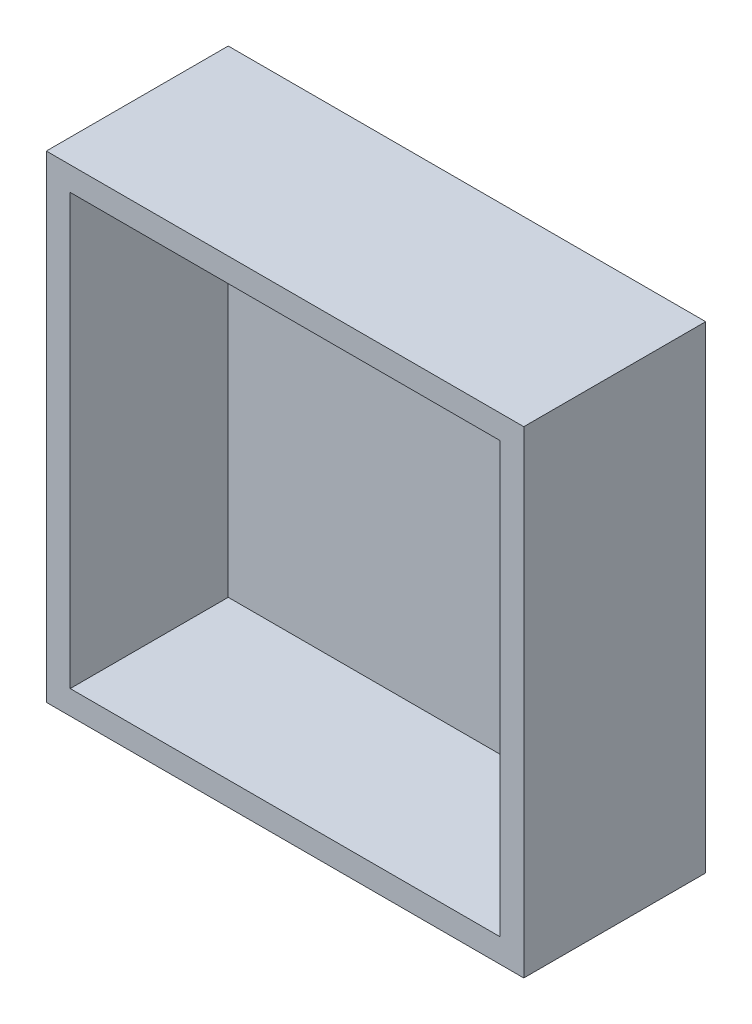
ISO-10303-21;
HEADER;
FILE_DESCRIPTION(('STEP AP214'),'2;1');
FILE_NAME('part.step','',(''),(''),'','','');
FILE_SCHEMA(('AUTOMOTIVE_DESIGN { 1 0 10303 214 1 1 1 1 }'));
ENDSEC;
DATA;
#1=APPLICATION_CONTEXT('core data for automotive mechanical design processes');
#2=APPLICATION_PROTOCOL_DEFINITION('international standard','automotive_design',2000,#1);
#3=PRODUCT_CONTEXT('',#1,'mechanical');
#4=PRODUCT('Part','Part','',(#3));
#5=PRODUCT_RELATED_PRODUCT_CATEGORY('part','',(#4));
#6=PRODUCT_DEFINITION_FORMATION('','',#4);
#7=PRODUCT_DEFINITION_CONTEXT('part definition',#1,'design');
#8=PRODUCT_DEFINITION('design','',#6,#7);
#9=PRODUCT_DEFINITION_SHAPE('','',#8);
#10=(LENGTH_UNIT() NAMED_UNIT(*) SI_UNIT(.MILLI.,.METRE.));
#11=(NAMED_UNIT(*) PLANE_ANGLE_UNIT() SI_UNIT($,.RADIAN.));
#12=(NAMED_UNIT(*) SI_UNIT($,.STERADIAN.) SOLID_ANGLE_UNIT());
#13=UNCERTAINTY_MEASURE_WITH_UNIT(LENGTH_MEASURE(1.E-05),#10,'distance_accuracy_value','');
#14=(GEOMETRIC_REPRESENTATION_CONTEXT(3) GLOBAL_UNCERTAINTY_ASSIGNED_CONTEXT((#13)) GLOBAL_UNIT_ASSIGNED_CONTEXT((#10,
#11,#12)) REPRESENTATION_CONTEXT('',''));
#15=CARTESIAN_POINT('',(0.,0.,0.));
#16=DIRECTION('',(0.,0.,1.));
#17=DIRECTION('',(1.,0.,0.));
#18=AXIS2_PLACEMENT_3D('',#15,#16,#17);
#19=CARTESIAN_POINT('',(-190.,190.,-3.8));
#20=DIRECTION('',(-1.,0.,0.));
#21=DIRECTION('',(0.,-1.,0.));
#22=AXIS2_PLACEMENT_3D('',#19,#20,#21);
#23=PLANE('',#22);
#24=DIRECTION('',(0.,-1.,0.));
#25=VECTOR('',#24,1.);
#26=CARTESIAN_POINT('',(-190.,9.99999999999998,10.));
#27=LINE('',#26,#25);
#28=CARTESIAN_POINT('',(-190.,190.,10.));
#29=VERTEX_POINT('',#28);
#30=CARTESIAN_POINT('',(-190.,9.99999999999998,10.));
#31=VERTEX_POINT('',#30);
#32=EDGE_CURVE('E55',#29,#31,#27,.T.);
#33=ORIENTED_EDGE('',*,*,#32,.F.);
#34=DIRECTION('',(0.,0.,1.));
#35=VECTOR('',#34,1.);
#36=CARTESIAN_POINT('',(-190.,190.,-3.8));
#37=LINE('',#36,#35);
#38=CARTESIAN_POINT('',(-190.,190.,76.2));
#39=VERTEX_POINT('',#38);
#40=EDGE_CURVE('E146',#29,#39,#37,.T.);
#41=ORIENTED_EDGE('',*,*,#40,.T.);
#42=DIRECTION('',(0.,-1.,0.));
#43=VECTOR('',#42,1.);
#44=CARTESIAN_POINT('',(-190.,190.,76.2));
#45=LINE('',#44,#43);
#46=CARTESIAN_POINT('',(-190.,9.99999999999998,76.2));
#47=VERTEX_POINT('',#46);
#48=EDGE_CURVE('E133',#39,#47,#45,.T.);
#49=ORIENTED_EDGE('',*,*,#48,.T.);
#50=DIRECTION('',(0.,0.,1.));
#51=VECTOR('',#50,1.);
#52=CARTESIAN_POINT('',(-190.,9.99999999999998,-3.8));
#53=LINE('',#52,#51);
#54=EDGE_CURVE('E117',#31,#47,#53,.T.);
#55=ORIENTED_EDGE('',*,*,#54,.F.);
#56=EDGE_LOOP('',(#33,#41,#49,#55));
#57=FACE_BOUND('',#56,.T.);
#58=ADVANCED_FACE('F39',(#57),#23,.F.);
#59=CARTESIAN_POINT('',(-190.,190.,-3.8));
#60=DIRECTION('',(0.,1.,0.));
#61=DIRECTION('',(0.,0.,1.));
#62=AXIS2_PLACEMENT_3D('',#59,#60,#61);
#63=PLANE('',#62);
#64=DIRECTION('',(-1.,0.,0.));
#65=VECTOR('',#64,1.);
#66=CARTESIAN_POINT('',(-190.,190.,10.));
#67=LINE('',#66,#65);
#68=CARTESIAN_POINT('',(-10.,190.,10.));
#69=VERTEX_POINT('',#68);
#70=EDGE_CURVE('E62',#69,#29,#67,.T.);
#71=ORIENTED_EDGE('',*,*,#70,.F.);
#72=DIRECTION('',(0.,0.,1.));
#73=VECTOR('',#72,1.);
#74=CARTESIAN_POINT('',(-10.,190.,-3.8));
#75=LINE('',#74,#73);
#76=CARTESIAN_POINT('',(-10.,190.,76.2));
#77=VERTEX_POINT('',#76);
#78=EDGE_CURVE('E116',#69,#77,#75,.T.);
#79=ORIENTED_EDGE('',*,*,#78,.T.);
#80=DIRECTION('',(-1.,0.,0.));
#81=VECTOR('',#80,1.);
#82=CARTESIAN_POINT('',(-190.,190.,76.2));
#83=LINE('',#82,#81);
#84=EDGE_CURVE('E142',#77,#39,#83,.T.);
#85=ORIENTED_EDGE('',*,*,#84,.T.);
#86=ORIENTED_EDGE('',*,*,#40,.F.);
#87=EDGE_LOOP('',(#71,#79,#85,#86));
#88=FACE_BOUND('',#87,.T.);
#89=ADVANCED_FACE('F216',(#88),#63,.F.);
#90=CARTESIAN_POINT('',(-10.,190.,-3.8));
#91=DIRECTION('',(1.,0.,0.));
#92=DIRECTION('',(0.,1.,0.));
#93=AXIS2_PLACEMENT_3D('',#90,#91,#92);
#94=PLANE('',#93);
#95=DIRECTION('',(0.,1.,0.));
#96=VECTOR('',#95,1.);
#97=CARTESIAN_POINT('',(-10.,190.,10.));
#98=LINE('',#97,#96);
#99=CARTESIAN_POINT('',(-9.99999999999998,9.99999999999998,10.));
#100=VERTEX_POINT('',#99);
#101=EDGE_CURVE('E120',#100,#69,#98,.T.);
#102=ORIENTED_EDGE('',*,*,#101,.F.);
#103=DIRECTION('',(0.,0.,1.));
#104=VECTOR('',#103,1.);
#105=CARTESIAN_POINT('',(-9.99999999999998,9.99999999999998,-3.8));
#106=LINE('',#105,#104);
#107=CARTESIAN_POINT('',(-9.99999999999998,9.99999999999998,76.2));
#108=VERTEX_POINT('',#107);
#109=EDGE_CURVE('E105',#100,#108,#106,.T.);
#110=ORIENTED_EDGE('',*,*,#109,.T.);
#111=DIRECTION('',(0.,1.,0.));
#112=VECTOR('',#111,1.);
#113=CARTESIAN_POINT('',(-10.,190.,76.2));
#114=LINE('',#113,#112);
#115=EDGE_CURVE('E139',#108,#77,#114,.T.);
#116=ORIENTED_EDGE('',*,*,#115,.T.);
#117=ORIENTED_EDGE('',*,*,#78,.F.);
#118=EDGE_LOOP('',(#102,#110,#116,#117));
#119=FACE_BOUND('',#118,.T.);
#120=ADVANCED_FACE('F121',(#119),#94,.F.);
#121=CARTESIAN_POINT('',(-190.,9.99999999999998,-3.8));
#122=DIRECTION('',(0.,-1.,0.));
#123=DIRECTION('',(0.,0.,-1.));
#124=AXIS2_PLACEMENT_3D('',#121,#122,#123);
#125=PLANE('',#124);
#126=DIRECTION('',(1.,0.,0.));
#127=VECTOR('',#126,1.);
#128=CARTESIAN_POINT('',(-9.99999999999998,9.99999999999998,10.));
#129=LINE('',#128,#127);
#130=EDGE_CURVE('E109',#31,#100,#129,.T.);
#131=ORIENTED_EDGE('',*,*,#130,.F.);
#132=ORIENTED_EDGE('',*,*,#54,.T.);
#133=DIRECTION('',(1.,0.,0.));
#134=VECTOR('',#133,1.);
#135=CARTESIAN_POINT('',(-190.,9.99999999999998,76.2));
#136=LINE('',#135,#134);
#137=EDGE_CURVE('E111',#47,#108,#136,.T.);
#138=ORIENTED_EDGE('',*,*,#137,.T.);
#139=ORIENTED_EDGE('',*,*,#109,.F.);
#140=EDGE_LOOP('',(#131,#132,#138,#139));
#141=FACE_BOUND('',#140,.T.);
#142=ADVANCED_FACE('F107',(#141),#125,.F.);
#143=CARTESIAN_POINT('',(0.,0.,76.2));
#144=DIRECTION('',(-1.,0.,0.));
#145=DIRECTION('',(0.,0.,1.));
#146=AXIS2_PLACEMENT_3D('',#143,#144,#145);
#147=PLANE('',#146);
#148=DIRECTION('',(0.,1.,0.));
#149=VECTOR('',#148,1.);
#150=CARTESIAN_POINT('',(0.,0.,0.));
#151=LINE('',#150,#149);
#152=CARTESIAN_POINT('',(0.,0.,0.));
#153=VERTEX_POINT('',#152);
#154=CARTESIAN_POINT('',(0.,200.,0.));
#155=VERTEX_POINT('',#154);
#156=EDGE_CURVE('E149',#153,#155,#151,.T.);
#157=ORIENTED_EDGE('',*,*,#156,.T.);
#158=DIRECTION('',(0.,0.,-1.));
#159=VECTOR('',#158,1.);
#160=CARTESIAN_POINT('',(0.,200.,76.2));
#161=LINE('',#160,#159);
#162=CARTESIAN_POINT('',(0.,200.,76.2));
#163=VERTEX_POINT('',#162);
#164=EDGE_CURVE('E11',#163,#155,#161,.T.);
#165=ORIENTED_EDGE('',*,*,#164,.F.);
#166=DIRECTION('',(0.,1.,0.));
#167=VECTOR('',#166,1.);
#168=CARTESIAN_POINT('',(0.,0.,76.2));
#169=LINE('',#168,#167);
#170=CARTESIAN_POINT('',(0.,0.,76.2));
#171=VERTEX_POINT('',#170);
#172=EDGE_CURVE('E154',#171,#163,#169,.T.);
#173=ORIENTED_EDGE('',*,*,#172,.F.);
#174=DIRECTION('',(0.,0.,-1.));
#175=VECTOR('',#174,1.);
#176=CARTESIAN_POINT('',(0.,0.,76.2));
#177=LINE('',#176,#175);
#178=EDGE_CURVE('E168',#171,#153,#177,.T.);
#179=ORIENTED_EDGE('',*,*,#178,.T.);
#180=EDGE_LOOP('',(#157,#165,#173,#179));
#181=FACE_BOUND('',#180,.T.);
#182=ADVANCED_FACE('F41',(#181),#147,.F.);
#183=CARTESIAN_POINT('',(0.,200.,76.2));
#184=DIRECTION('',(0.,-1.,0.));
#185=DIRECTION('',(1.,0.,0.));
#186=AXIS2_PLACEMENT_3D('',#183,#184,#185);
#187=PLANE('',#186);
#188=DIRECTION('',(-1.,0.,0.));
#189=VECTOR('',#188,1.);
#190=CARTESIAN_POINT('',(0.,200.,0.));
#191=LINE('',#190,#189);
#192=CARTESIAN_POINT('',(-200.,200.,0.));
#193=VERTEX_POINT('',#192);
#194=EDGE_CURVE('E172',#155,#193,#191,.T.);
#195=ORIENTED_EDGE('',*,*,#194,.T.);
#196=DIRECTION('',(0.,0.,-1.));
#197=VECTOR('',#196,1.);
#198=CARTESIAN_POINT('',(-200.,200.,76.2));
#199=LINE('',#198,#197);
#200=CARTESIAN_POINT('',(-200.,200.,76.2));
#201=VERTEX_POINT('',#200);
#202=EDGE_CURVE('E48',#201,#193,#199,.T.);
#203=ORIENTED_EDGE('',*,*,#202,.F.);
#204=DIRECTION('',(-1.,0.,0.));
#205=VECTOR('',#204,1.);
#206=CARTESIAN_POINT('',(0.,200.,76.2));
#207=LINE('',#206,#205);
#208=EDGE_CURVE('E158',#163,#201,#207,.T.);
#209=ORIENTED_EDGE('',*,*,#208,.F.);
#210=ORIENTED_EDGE('',*,*,#164,.T.);
#211=EDGE_LOOP('',(#195,#203,#209,#210));
#212=FACE_BOUND('',#211,.T.);
#213=ADVANCED_FACE('F208',(#212),#187,.F.);
#214=CARTESIAN_POINT('',(-200.,0.,76.2));
#215=DIRECTION('',(1.,0.,0.));
#216=DIRECTION('',(0.,0.,-1.));
#217=AXIS2_PLACEMENT_3D('',#214,#215,#216);
#218=PLANE('',#217);
#219=DIRECTION('',(0.,-1.,0.));
#220=VECTOR('',#219,1.);
#221=CARTESIAN_POINT('',(-200.,0.,0.));
#222=LINE('',#221,#220);
#223=CARTESIAN_POINT('',(-200.,0.,0.));
#224=VERTEX_POINT('',#223);
#225=EDGE_CURVE('E175',#193,#224,#222,.T.);
#226=ORIENTED_EDGE('',*,*,#225,.T.);
#227=DIRECTION('',(0.,0.,-1.));
#228=VECTOR('',#227,1.);
#229=CARTESIAN_POINT('',(-200.,0.,76.2));
#230=LINE('',#229,#228);
#231=CARTESIAN_POINT('',(-200.,0.,76.2));
#232=VERTEX_POINT('',#231);
#233=EDGE_CURVE('E183',#232,#224,#230,.T.);
#234=ORIENTED_EDGE('',*,*,#233,.F.);
#235=DIRECTION('',(0.,-1.,0.));
#236=VECTOR('',#235,1.);
#237=CARTESIAN_POINT('',(-200.,0.,76.2));
#238=LINE('',#237,#236);
#239=EDGE_CURVE('E162',#201,#232,#238,.T.);
#240=ORIENTED_EDGE('',*,*,#239,.F.);
#241=ORIENTED_EDGE('',*,*,#202,.T.);
#242=EDGE_LOOP('',(#226,#234,#240,#241));
#243=FACE_BOUND('',#242,.T.);
#244=ADVANCED_FACE('F192',(#243),#218,.F.);
#245=CARTESIAN_POINT('',(0.,0.,76.2));
#246=DIRECTION('',(0.,1.,0.));
#247=DIRECTION('',(-1.,0.,0.));
#248=AXIS2_PLACEMENT_3D('',#245,#246,#247);
#249=PLANE('',#248);
#250=DIRECTION('',(1.,0.,0.));
#251=VECTOR('',#250,1.);
#252=CARTESIAN_POINT('',(0.,0.,0.));
#253=LINE('',#252,#251);
#254=EDGE_CURVE('E159',#224,#153,#253,.T.);
#255=ORIENTED_EDGE('',*,*,#254,.T.);
#256=ORIENTED_EDGE('',*,*,#178,.F.);
#257=DIRECTION('',(1.,0.,0.));
#258=VECTOR('',#257,1.);
#259=CARTESIAN_POINT('',(0.,0.,76.2));
#260=LINE('',#259,#258);
#261=EDGE_CURVE('E165',#232,#171,#260,.T.);
#262=ORIENTED_EDGE('',*,*,#261,.F.);
#263=ORIENTED_EDGE('',*,*,#233,.T.);
#264=EDGE_LOOP('',(#255,#256,#262,#263));
#265=FACE_BOUND('',#264,.T.);
#266=ADVANCED_FACE('F201',(#265),#249,.F.);
#267=CARTESIAN_POINT('',(0.,0.,76.2));
#268=DIRECTION('',(0.,0.,1.));
#269=DIRECTION('',(1.,0.,0.));
#270=AXIS2_PLACEMENT_3D('',#267,#268,#269);
#271=PLANE('',#270);
#272=ORIENTED_EDGE('',*,*,#48,.F.);
#273=ORIENTED_EDGE('',*,*,#84,.F.);
#274=ORIENTED_EDGE('',*,*,#115,.F.);
#275=ORIENTED_EDGE('',*,*,#137,.F.);
#276=EDGE_LOOP('',(#272,#273,#274,#275));
#277=FACE_BOUND('',#276,.T.);
#278=ORIENTED_EDGE('',*,*,#172,.T.);
#279=ORIENTED_EDGE('',*,*,#208,.T.);
#280=ORIENTED_EDGE('',*,*,#239,.T.);
#281=ORIENTED_EDGE('',*,*,#261,.T.);
#282=EDGE_LOOP('',(#278,#279,#280,#281));
#283=FACE_BOUND('',#282,.T.);
#284=ADVANCED_FACE('F207',(#277,#283),#271,.T.);
#285=CARTESIAN_POINT('',(0.,0.,0.));
#286=DIRECTION('',(0.,0.,1.));
#287=DIRECTION('',(1.,0.,0.));
#288=AXIS2_PLACEMENT_3D('',#285,#286,#287);
#289=PLANE('',#288);
#290=ORIENTED_EDGE('',*,*,#156,.F.);
#291=ORIENTED_EDGE('',*,*,#254,.F.);
#292=ORIENTED_EDGE('',*,*,#225,.F.);
#293=ORIENTED_EDGE('',*,*,#194,.F.);
#294=EDGE_LOOP('',(#290,#291,#292,#293));
#295=FACE_BOUND('',#294,.T.);
#296=ADVANCED_FACE('F198',(#295),#289,.F.);
#297=CARTESIAN_POINT('',(0.,0.,10.));
#298=DIRECTION('',(0.,0.,-1.));
#299=DIRECTION('',(-1.,0.,0.));
#300=AXIS2_PLACEMENT_3D('',#297,#298,#299);
#301=PLANE('',#300);
#302=ORIENTED_EDGE('',*,*,#32,.T.);
#303=ORIENTED_EDGE('',*,*,#130,.T.);
#304=ORIENTED_EDGE('',*,*,#101,.T.);
#305=ORIENTED_EDGE('',*,*,#70,.T.);
#306=EDGE_LOOP('',(#302,#303,#304,#305));
#307=FACE_BOUND('',#306,.T.);
#308=ADVANCED_FACE('F125',(#307),#301,.F.);
#309=CLOSED_SHELL('',(#58,#89,#120,#142,#182,#213,#244,#266,#284,#296,#308));
#310=MANIFOLD_SOLID_BREP('B2',#309);
#311=ADVANCED_BREP_SHAPE_REPRESENTATION('',(#18,#310),#14);
#312=SHAPE_DEFINITION_REPRESENTATION(#9,#311);
ENDSEC;
END-ISO-10303-21;
